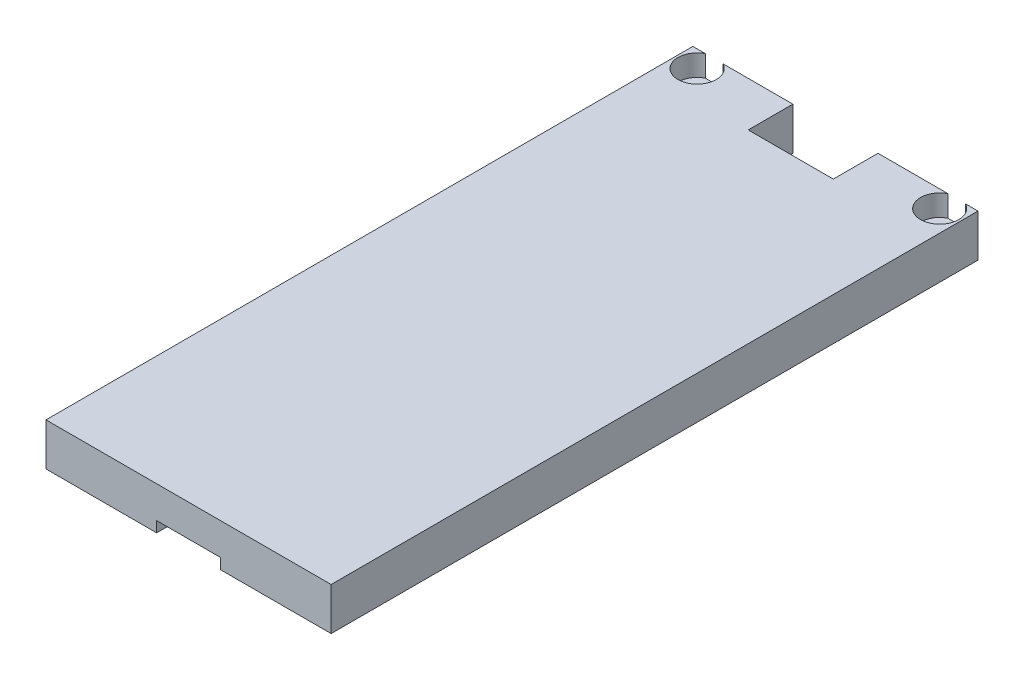
ISO-10303-21;
HEADER;
FILE_DESCRIPTION(('STEP AP214'),'2;1');
FILE_NAME('part.step','',(''),(''),'','','');
FILE_SCHEMA(('AUTOMOTIVE_DESIGN { 1 0 10303 214 1 1 1 1 }'));
ENDSEC;
DATA;
#1=APPLICATION_CONTEXT('core data for automotive mechanical design processes');
#2=APPLICATION_PROTOCOL_DEFINITION('international standard','automotive_design',2000,#1);
#3=PRODUCT_CONTEXT('',#1,'mechanical');
#4=PRODUCT('Part','Part','',(#3));
#5=PRODUCT_RELATED_PRODUCT_CATEGORY('part','',(#4));
#6=PRODUCT_DEFINITION_FORMATION('','',#4);
#7=PRODUCT_DEFINITION_CONTEXT('part definition',#1,'design');
#8=PRODUCT_DEFINITION('design','',#6,#7);
#9=PRODUCT_DEFINITION_SHAPE('','',#8);
#10=(LENGTH_UNIT() NAMED_UNIT(*) SI_UNIT(.MILLI.,.METRE.));
#11=(NAMED_UNIT(*) PLANE_ANGLE_UNIT() SI_UNIT($,.RADIAN.));
#12=(NAMED_UNIT(*) SI_UNIT($,.STERADIAN.) SOLID_ANGLE_UNIT());
#13=UNCERTAINTY_MEASURE_WITH_UNIT(LENGTH_MEASURE(1.E-05),#10,'distance_accuracy_value','');
#14=(GEOMETRIC_REPRESENTATION_CONTEXT(3) GLOBAL_UNCERTAINTY_ASSIGNED_CONTEXT((#13)) GLOBAL_UNIT_ASSIGNED_CONTEXT((#10,
#11,#12)) REPRESENTATION_CONTEXT('',''));
#15=CARTESIAN_POINT('',(0.,0.,0.));
#16=DIRECTION('',(0.,0.,1.));
#17=DIRECTION('',(1.,0.,0.));
#18=AXIS2_PLACEMENT_3D('',#15,#16,#17);
#19=CARTESIAN_POINT('',(0.,0.,0.));
#20=DIRECTION('',(0.,0.,-1.));
#21=DIRECTION('',(-1.,0.,0.));
#22=AXIS2_PLACEMENT_3D('',#19,#20,#21);
#23=PLANE('',#22);
#24=DIRECTION('',(-1.,0.,0.));
#25=VECTOR('',#24,1.);
#26=CARTESIAN_POINT('',(-33.5,10.,0.));
#27=LINE('',#26,#25);
#28=CARTESIAN_POINT('',(26.44,9.99999999999999,0.));
#29=VERTEX_POINT('',#28);
#30=CARTESIAN_POINT('',(10.,9.99999999999999,0.));
#31=VERTEX_POINT('',#30);
#32=EDGE_CURVE('E160',#29,#31,#27,.T.);
#33=ORIENTED_EDGE('',*,*,#32,.F.);
#34=DIRECTION('',(0.,1.,0.));
#35=VECTOR('',#34,1.);
#36=CARTESIAN_POINT('',(26.44,4.99999999999999,0.));
#37=LINE('',#36,#35);
#38=CARTESIAN_POINT('',(26.44,4.99999999999999,0.));
#39=VERTEX_POINT('',#38);
#40=EDGE_CURVE('E148',#39,#29,#37,.T.);
#41=ORIENTED_EDGE('',*,*,#40,.F.);
#42=DIRECTION('',(1.,0.,0.));
#43=VECTOR('',#42,1.);
#44=CARTESIAN_POINT('',(0.,4.99999999999999,0.));
#45=LINE('',#44,#43);
#46=CARTESIAN_POINT('',(30.56,5.,0.));
#47=VERTEX_POINT('',#46);
#48=EDGE_CURVE('E152',#39,#47,#45,.T.);
#49=ORIENTED_EDGE('',*,*,#48,.T.);
#50=DIRECTION('',(0.,1.,0.));
#51=VECTOR('',#50,1.);
#52=CARTESIAN_POINT('',(30.56,4.99999999999999,0.));
#53=LINE('',#52,#51);
#54=CARTESIAN_POINT('',(30.56,9.99999999999999,0.));
#55=VERTEX_POINT('',#54);
#56=EDGE_CURVE('E48',#47,#55,#53,.T.);
#57=ORIENTED_EDGE('',*,*,#56,.T.);
#58=CARTESIAN_POINT('',(33.5,9.99999999999999,0.));
#59=VERTEX_POINT('',#58);
#60=EDGE_CURVE('E245',#59,#55,#27,.T.);
#61=ORIENTED_EDGE('',*,*,#60,.F.);
#62=DIRECTION('',(0.,1.,0.));
#63=VECTOR('',#62,1.);
#64=CARTESIAN_POINT('',(33.5,9.99999999999999,0.));
#65=LINE('',#64,#63);
#66=CARTESIAN_POINT('',(33.5,0.,0.));
#67=VERTEX_POINT('',#66);
#68=EDGE_CURVE('E242',#67,#59,#65,.T.);
#69=ORIENTED_EDGE('',*,*,#68,.F.);
#70=DIRECTION('',(1.,0.,0.));
#71=VECTOR('',#70,1.);
#72=CARTESIAN_POINT('',(33.5,0.,0.));
#73=LINE('',#72,#71);
#74=CARTESIAN_POINT('',(10.,0.,0.));
#75=VERTEX_POINT('',#74);
#76=EDGE_CURVE('E240',#75,#67,#73,.T.);
#77=ORIENTED_EDGE('',*,*,#76,.F.);
#78=DIRECTION('',(0.,1.,0.));
#79=VECTOR('',#78,1.);
#80=CARTESIAN_POINT('',(10.,0.,0.));
#81=LINE('',#80,#79);
#82=EDGE_CURVE('E205',#75,#31,#81,.T.);
#83=ORIENTED_EDGE('',*,*,#82,.T.);
#84=EDGE_LOOP('',(#33,#41,#49,#57,#61,#69,#77,#83));
#85=FACE_BOUND('',#84,.T.);
#86=ADVANCED_FACE('F33',(#85),#23,.T.);
#87=DIRECTION('',(0.,1.,0.));
#88=VECTOR('',#87,1.);
#89=CARTESIAN_POINT('',(-30.56,4.99999999999999,0.));
#90=LINE('',#89,#88);
#91=CARTESIAN_POINT('',(-30.56,4.99999999999999,0.));
#92=VERTEX_POINT('',#91);
#93=CARTESIAN_POINT('',(-30.56,10.,0.));
#94=VERTEX_POINT('',#93);
#95=EDGE_CURVE('E56',#92,#94,#90,.T.);
#96=ORIENTED_EDGE('',*,*,#95,.F.);
#97=DIRECTION('',(-1.,0.,0.));
#98=VECTOR('',#97,1.);
#99=CARTESIAN_POINT('',(0.,4.99999999999999,0.));
#100=LINE('',#99,#98);
#101=CARTESIAN_POINT('',(-26.44,4.99999999999999,0.));
#102=VERTEX_POINT('',#101);
#103=EDGE_CURVE('E172',#102,#92,#100,.T.);
#104=ORIENTED_EDGE('',*,*,#103,.F.);
#105=DIRECTION('',(0.,1.,0.));
#106=VECTOR('',#105,1.);
#107=CARTESIAN_POINT('',(-26.44,4.99999999999999,0.));
#108=LINE('',#107,#106);
#109=CARTESIAN_POINT('',(-26.44,9.99999999999999,0.));
#110=VERTEX_POINT('',#109);
#111=EDGE_CURVE('E178',#102,#110,#108,.T.);
#112=ORIENTED_EDGE('',*,*,#111,.T.);
#113=CARTESIAN_POINT('',(-10.,9.99999999999999,0.));
#114=VERTEX_POINT('',#113);
#115=EDGE_CURVE('E248',#114,#110,#27,.T.);
#116=ORIENTED_EDGE('',*,*,#115,.F.);
#117=DIRECTION('',(0.,1.,0.));
#118=VECTOR('',#117,1.);
#119=CARTESIAN_POINT('',(-10.,0.,0.));
#120=LINE('',#119,#118);
#121=CARTESIAN_POINT('',(-10.,0.,0.));
#122=VERTEX_POINT('',#121);
#123=EDGE_CURVE('E202',#122,#114,#120,.T.);
#124=ORIENTED_EDGE('',*,*,#123,.F.);
#125=DIRECTION('',(1.,0.,0.));
#126=VECTOR('',#125,1.);
#127=CARTESIAN_POINT('',(-7.5,0.,0.));
#128=LINE('',#127,#126);
#129=CARTESIAN_POINT('',(-33.5,0.,0.));
#130=VERTEX_POINT('',#129);
#131=EDGE_CURVE('E218',#130,#122,#128,.T.);
#132=ORIENTED_EDGE('',*,*,#131,.F.);
#133=DIRECTION('',(0.,-1.,0.));
#134=VECTOR('',#133,1.);
#135=CARTESIAN_POINT('',(-33.5,0.,0.));
#136=LINE('',#135,#134);
#137=CARTESIAN_POINT('',(-33.5,10.,0.));
#138=VERTEX_POINT('',#137);
#139=EDGE_CURVE('E223',#138,#130,#136,.T.);
#140=ORIENTED_EDGE('',*,*,#139,.F.);
#141=EDGE_CURVE('E244',#94,#138,#27,.T.);
#142=ORIENTED_EDGE('',*,*,#141,.F.);
#143=EDGE_LOOP('',(#96,#104,#112,#116,#124,#132,#140,#142));
#144=FACE_BOUND('',#143,.T.);
#145=ADVANCED_FACE('F287',(#144),#23,.T.);
#146=CARTESIAN_POINT('',(-7.5,0.,152.));
#147=DIRECTION('',(0.,1.,0.));
#148=DIRECTION('',(-1.,0.,0.));
#149=AXIS2_PLACEMENT_3D('',#146,#147,#148);
#150=PLANE('',#149);
#151=CARTESIAN_POINT('',(-28.5,0.,4.000799920016));
#152=DIRECTION('',(0.,1.,0.));
#153=DIRECTION('',(-1.,0.,0.));
#154=AXIS2_PLACEMENT_3D('',#151,#152,#153);
#155=CIRCLE('',#154,2.6);
#156=CARTESIAN_POINT('',(-31.1,0.,4.000799920016));
#157=VERTEX_POINT('',#156);
#158=EDGE_CURVE('E166',#157,#157,#155,.T.);
#159=ORIENTED_EDGE('',*,*,#158,.T.);
#160=EDGE_LOOP('',(#159));
#161=FACE_BOUND('',#160,.T.);
#162=ORIENTED_EDGE('',*,*,#131,.T.);
#163=DIRECTION('',(0.,0.,1.));
#164=VECTOR('',#163,1.);
#165=CARTESIAN_POINT('',(-10.,0.,0.));
#166=LINE('',#165,#164);
#167=CARTESIAN_POINT('',(-10.,0.,10.5));
#168=VERTEX_POINT('',#167);
#169=EDGE_CURVE('E183',#122,#168,#166,.T.);
#170=ORIENTED_EDGE('',*,*,#169,.T.);
#171=DIRECTION('',(1.,0.,0.));
#172=VECTOR('',#171,1.);
#173=CARTESIAN_POINT('',(-10.,0.,10.5));
#174=LINE('',#173,#172);
#175=CARTESIAN_POINT('',(-7.5,0.,10.5));
#176=VERTEX_POINT('',#175);
#177=EDGE_CURVE('E188',#168,#176,#174,.T.);
#178=ORIENTED_EDGE('',*,*,#177,.T.);
#179=DIRECTION('',(0.,0.,-1.));
#180=VECTOR('',#179,1.);
#181=CARTESIAN_POINT('',(-7.5,0.,152.));
#182=LINE('',#181,#180);
#183=CARTESIAN_POINT('',(-7.5,0.,152.));
#184=VERTEX_POINT('',#183);
#185=EDGE_CURVE('E11',#184,#176,#182,.T.);
#186=ORIENTED_EDGE('',*,*,#185,.F.);
#187=DIRECTION('',(1.,0.,0.));
#188=VECTOR('',#187,1.);
#189=CARTESIAN_POINT('',(-7.5,0.,152.));
#190=LINE('',#189,#188);
#191=CARTESIAN_POINT('',(-33.5,0.,152.));
#192=VERTEX_POINT('',#191);
#193=EDGE_CURVE('E219',#192,#184,#190,.T.);
#194=ORIENTED_EDGE('',*,*,#193,.F.);
#195=DIRECTION('',(0.,0.,-1.));
#196=VECTOR('',#195,1.);
#197=CARTESIAN_POINT('',(-33.5,0.,152.));
#198=LINE('',#197,#196);
#199=EDGE_CURVE('E237',#192,#130,#198,.T.);
#200=ORIENTED_EDGE('',*,*,#199,.T.);
#201=EDGE_LOOP('',(#162,#170,#178,#186,#194,#200));
#202=FACE_BOUND('',#201,.T.);
#203=ADVANCED_FACE('F35',(#161,#202),#150,.F.);
#204=CARTESIAN_POINT('',(-7.5,2.5,152.));
#205=DIRECTION('',(-1.,0.,0.));
#206=DIRECTION('',(0.,-1.,0.));
#207=AXIS2_PLACEMENT_3D('',#204,#205,#206);
#208=PLANE('',#207);
#209=ORIENTED_EDGE('',*,*,#185,.T.);
#210=DIRECTION('',(0.,1.,0.));
#211=VECTOR('',#210,1.);
#212=CARTESIAN_POINT('',(-7.5,2.5,10.5));
#213=LINE('',#212,#211);
#214=CARTESIAN_POINT('',(-7.5,2.5,10.5));
#215=VERTEX_POINT('',#214);
#216=EDGE_CURVE('E215',#176,#215,#213,.T.);
#217=ORIENTED_EDGE('',*,*,#216,.T.);
#218=DIRECTION('',(0.,0.,-1.));
#219=VECTOR('',#218,1.);
#220=CARTESIAN_POINT('',(-7.5,2.5,152.));
#221=LINE('',#220,#219);
#222=CARTESIAN_POINT('',(-7.5,2.5,152.));
#223=VERTEX_POINT('',#222);
#224=EDGE_CURVE('E41',#223,#215,#221,.T.);
#225=ORIENTED_EDGE('',*,*,#224,.F.);
#226=DIRECTION('',(0.,1.,0.));
#227=VECTOR('',#226,1.);
#228=CARTESIAN_POINT('',(-7.5,2.5,152.));
#229=LINE('',#228,#227);
#230=EDGE_CURVE('E222',#184,#223,#229,.T.);
#231=ORIENTED_EDGE('',*,*,#230,.F.);
#232=EDGE_LOOP('',(#209,#217,#225,#231));
#233=FACE_BOUND('',#232,.T.);
#234=ADVANCED_FACE('F273',(#233),#208,.F.);
#235=CARTESIAN_POINT('',(7.5,2.5,152.));
#236=DIRECTION('',(0.,1.,0.));
#237=DIRECTION('',(-1.,0.,0.));
#238=AXIS2_PLACEMENT_3D('',#235,#236,#237);
#239=PLANE('',#238);
#240=ORIENTED_EDGE('',*,*,#224,.T.);
#241=DIRECTION('',(1.,0.,0.));
#242=VECTOR('',#241,1.);
#243=CARTESIAN_POINT('',(7.50000000000002,2.5,10.5));
#244=LINE('',#243,#242);
#245=CARTESIAN_POINT('',(7.5,2.5,10.5));
#246=VERTEX_POINT('',#245);
#247=EDGE_CURVE('E212',#215,#246,#244,.T.);
#248=ORIENTED_EDGE('',*,*,#247,.T.);
#249=DIRECTION('',(0.,0.,-1.));
#250=VECTOR('',#249,1.);
#251=CARTESIAN_POINT('',(7.5,2.5,152.));
#252=LINE('',#251,#250);
#253=CARTESIAN_POINT('',(7.5,2.5,152.));
#254=VERTEX_POINT('',#253);
#255=EDGE_CURVE('E264',#254,#246,#252,.T.);
#256=ORIENTED_EDGE('',*,*,#255,.F.);
#257=DIRECTION('',(1.,0.,0.));
#258=VECTOR('',#257,1.);
#259=CARTESIAN_POINT('',(7.5,2.5,152.));
#260=LINE('',#259,#258);
#261=EDGE_CURVE('E225',#223,#254,#260,.T.);
#262=ORIENTED_EDGE('',*,*,#261,.F.);
#263=EDGE_LOOP('',(#240,#248,#256,#262));
#264=FACE_BOUND('',#263,.T.);
#265=ADVANCED_FACE('F270',(#264),#239,.F.);
#266=CARTESIAN_POINT('',(7.5,0.,152.));
#267=DIRECTION('',(1.,0.,0.));
#268=DIRECTION('',(0.,1.,0.));
#269=AXIS2_PLACEMENT_3D('',#266,#267,#268);
#270=PLANE('',#269);
#271=ORIENTED_EDGE('',*,*,#255,.T.);
#272=DIRECTION('',(0.,-1.,0.));
#273=VECTOR('',#272,1.);
#274=CARTESIAN_POINT('',(7.5,0.,10.5));
#275=LINE('',#274,#273);
#276=CARTESIAN_POINT('',(7.5,0.,10.5));
#277=VERTEX_POINT('',#276);
#278=EDGE_CURVE('E204',#246,#277,#275,.T.);
#279=ORIENTED_EDGE('',*,*,#278,.T.);
#280=DIRECTION('',(0.,0.,-1.));
#281=VECTOR('',#280,1.);
#282=CARTESIAN_POINT('',(7.5,0.,152.));
#283=LINE('',#282,#281);
#284=CARTESIAN_POINT('',(7.5,0.,152.));
#285=VERTEX_POINT('',#284);
#286=EDGE_CURVE('E261',#285,#277,#283,.T.);
#287=ORIENTED_EDGE('',*,*,#286,.F.);
#288=DIRECTION('',(0.,-1.,0.));
#289=VECTOR('',#288,1.);
#290=CARTESIAN_POINT('',(7.5,0.,152.));
#291=LINE('',#290,#289);
#292=EDGE_CURVE('E227',#254,#285,#291,.T.);
#293=ORIENTED_EDGE('',*,*,#292,.F.);
#294=EDGE_LOOP('',(#271,#279,#287,#293));
#295=FACE_BOUND('',#294,.T.);
#296=ADVANCED_FACE('F352',(#295),#270,.F.);
#297=CARTESIAN_POINT('',(33.5,0.,152.));
#298=DIRECTION('',(0.,1.,0.));
#299=DIRECTION('',(-1.,0.,0.));
#300=AXIS2_PLACEMENT_3D('',#297,#298,#299);
#301=PLANE('',#300);
#302=CARTESIAN_POINT('',(28.5,0.,4.000799920016));
#303=DIRECTION('',(0.,-1.,0.));
#304=DIRECTION('',(1.,0.,0.));
#305=AXIS2_PLACEMENT_3D('',#302,#303,#304);
#306=CIRCLE('',#305,2.6);
#307=CARTESIAN_POINT('',(31.1,0.,4.000799920016));
#308=VERTEX_POINT('',#307);
#309=EDGE_CURVE('E319',#308,#308,#306,.T.);
#310=ORIENTED_EDGE('',*,*,#309,.F.);
#311=EDGE_LOOP('',(#310));
#312=FACE_BOUND('',#311,.T.);
#313=CARTESIAN_POINT('',(10.,0.,10.5));
#314=VERTEX_POINT('',#313);
#315=EDGE_CURVE('E186',#277,#314,#174,.T.);
#316=ORIENTED_EDGE('',*,*,#315,.T.);
#317=DIRECTION('',(0.,0.,-1.));
#318=VECTOR('',#317,1.);
#319=CARTESIAN_POINT('',(10.,0.,0.));
#320=LINE('',#319,#318);
#321=EDGE_CURVE('E191',#314,#75,#320,.T.);
#322=ORIENTED_EDGE('',*,*,#321,.T.);
#323=ORIENTED_EDGE('',*,*,#76,.T.);
#324=DIRECTION('',(0.,0.,-1.));
#325=VECTOR('',#324,1.);
#326=CARTESIAN_POINT('',(33.5,0.,152.));
#327=LINE('',#326,#325);
#328=CARTESIAN_POINT('',(33.5,0.,152.));
#329=VERTEX_POINT('',#328);
#330=EDGE_CURVE('E258',#329,#67,#327,.T.);
#331=ORIENTED_EDGE('',*,*,#330,.F.);
#332=DIRECTION('',(1.,0.,0.));
#333=VECTOR('',#332,1.);
#334=CARTESIAN_POINT('',(33.5,0.,152.));
#335=LINE('',#334,#333);
#336=EDGE_CURVE('E229',#285,#329,#335,.T.);
#337=ORIENTED_EDGE('',*,*,#336,.F.);
#338=ORIENTED_EDGE('',*,*,#286,.T.);
#339=EDGE_LOOP('',(#316,#322,#323,#331,#337,#338));
#340=FACE_BOUND('',#339,.T.);
#341=ADVANCED_FACE('F313',(#312,#340),#301,.F.);
#342=CARTESIAN_POINT('',(33.5,9.99999999999999,152.));
#343=DIRECTION('',(-1.,0.,0.));
#344=DIRECTION('',(0.,0.,1.));
#345=AXIS2_PLACEMENT_3D('',#342,#343,#344);
#346=PLANE('',#345);
#347=ORIENTED_EDGE('',*,*,#68,.T.);
#348=DIRECTION('',(0.,0.,-1.));
#349=VECTOR('',#348,1.);
#350=CARTESIAN_POINT('',(33.5,9.99999999999999,152.));
#351=LINE('',#350,#349);
#352=CARTESIAN_POINT('',(33.5,9.99999999999999,152.));
#353=VERTEX_POINT('',#352);
#354=EDGE_CURVE('E255',#353,#59,#351,.T.);
#355=ORIENTED_EDGE('',*,*,#354,.F.);
#356=DIRECTION('',(0.,1.,0.));
#357=VECTOR('',#356,1.);
#358=CARTESIAN_POINT('',(33.5,9.99999999999999,152.));
#359=LINE('',#358,#357);
#360=EDGE_CURVE('E231',#329,#353,#359,.T.);
#361=ORIENTED_EDGE('',*,*,#360,.F.);
#362=ORIENTED_EDGE('',*,*,#330,.T.);
#363=EDGE_LOOP('',(#347,#355,#361,#362));
#364=FACE_BOUND('',#363,.T.);
#365=ADVANCED_FACE('F308',(#364),#346,.F.);
#366=CARTESIAN_POINT('',(-33.5,10.,152.));
#367=DIRECTION('',(0.,-1.,0.));
#368=DIRECTION('',(1.,0.,0.));
#369=AXIS2_PLACEMENT_3D('',#366,#367,#368);
#370=PLANE('',#369);
#371=CARTESIAN_POINT('',(28.5,9.99999999999999,4.000799920016));
#372=DIRECTION('',(0.,-1.,0.));
#373=DIRECTION('',(1.,0.,0.));
#374=AXIS2_PLACEMENT_3D('',#371,#372,#373);
#375=CIRCLE('',#374,4.5);
#376=EDGE_CURVE('E156',#55,#29,#375,.T.);
#377=ORIENTED_EDGE('',*,*,#376,.T.);
#378=ORIENTED_EDGE('',*,*,#32,.T.);
#379=DIRECTION('',(0.,0.,-1.));
#380=VECTOR('',#379,1.);
#381=CARTESIAN_POINT('',(10.,9.99999999999999,0.));
#382=LINE('',#381,#380);
#383=CARTESIAN_POINT('',(10.,9.99999999999999,10.5));
#384=VERTEX_POINT('',#383);
#385=EDGE_CURVE('E187',#384,#31,#382,.T.);
#386=ORIENTED_EDGE('',*,*,#385,.F.);
#387=DIRECTION('',(1.,0.,0.));
#388=VECTOR('',#387,1.);
#389=CARTESIAN_POINT('',(-10.,9.99999999999999,10.5));
#390=LINE('',#389,#388);
#391=CARTESIAN_POINT('',(-10.,9.99999999999999,10.5));
#392=VERTEX_POINT('',#391);
#393=EDGE_CURVE('E197',#392,#384,#390,.T.);
#394=ORIENTED_EDGE('',*,*,#393,.F.);
#395=DIRECTION('',(0.,0.,1.));
#396=VECTOR('',#395,1.);
#397=CARTESIAN_POINT('',(-10.,9.99999999999999,0.));
#398=LINE('',#397,#396);
#399=EDGE_CURVE('E181',#114,#392,#398,.T.);
#400=ORIENTED_EDGE('',*,*,#399,.F.);
#401=ORIENTED_EDGE('',*,*,#115,.T.);
#402=CARTESIAN_POINT('',(-28.5,9.99999999999999,4.000799920016));
#403=DIRECTION('',(0.,1.,0.));
#404=DIRECTION('',(-1.,0.,0.));
#405=AXIS2_PLACEMENT_3D('',#402,#403,#404);
#406=CIRCLE('',#405,4.5);
#407=EDGE_CURVE('E169',#94,#110,#406,.T.);
#408=ORIENTED_EDGE('',*,*,#407,.F.);
#409=ORIENTED_EDGE('',*,*,#141,.T.);
#410=DIRECTION('',(0.,0.,-1.));
#411=VECTOR('',#410,1.);
#412=CARTESIAN_POINT('',(-33.5,10.,152.));
#413=LINE('',#412,#411);
#414=CARTESIAN_POINT('',(-33.5,10.,152.));
#415=VERTEX_POINT('',#414);
#416=EDGE_CURVE('E252',#415,#138,#413,.T.);
#417=ORIENTED_EDGE('',*,*,#416,.F.);
#418=DIRECTION('',(-1.,0.,0.));
#419=VECTOR('',#418,1.);
#420=CARTESIAN_POINT('',(-33.5,10.,152.));
#421=LINE('',#420,#419);
#422=EDGE_CURVE('E233',#353,#415,#421,.T.);
#423=ORIENTED_EDGE('',*,*,#422,.F.);
#424=ORIENTED_EDGE('',*,*,#354,.T.);
#425=ORIENTED_EDGE('',*,*,#60,.T.);
#426=EDGE_LOOP('',(#377,#378,#386,#394,#400,#401,#408,#409,#417,#423,#424,#425));
#427=FACE_BOUND('',#426,.T.);
#428=ADVANCED_FACE('F294',(#427),#370,.F.);
#429=CARTESIAN_POINT('',(-33.5,0.,152.));
#430=DIRECTION('',(1.,0.,0.));
#431=DIRECTION('',(0.,0.,-1.));
#432=AXIS2_PLACEMENT_3D('',#429,#430,#431);
#433=PLANE('',#432);
#434=ORIENTED_EDGE('',*,*,#139,.T.);
#435=ORIENTED_EDGE('',*,*,#199,.F.);
#436=DIRECTION('',(0.,-1.,0.));
#437=VECTOR('',#436,1.);
#438=CARTESIAN_POINT('',(-33.5,0.,152.));
#439=LINE('',#438,#437);
#440=EDGE_CURVE('E235',#415,#192,#439,.T.);
#441=ORIENTED_EDGE('',*,*,#440,.F.);
#442=ORIENTED_EDGE('',*,*,#416,.T.);
#443=EDGE_LOOP('',(#434,#435,#441,#442));
#444=FACE_BOUND('',#443,.T.);
#445=ADVANCED_FACE('F298',(#444),#433,.F.);
#446=CARTESIAN_POINT('',(0.,0.,152.));
#447=DIRECTION('',(0.,0.,-1.));
#448=DIRECTION('',(-1.,0.,0.));
#449=AXIS2_PLACEMENT_3D('',#446,#447,#448);
#450=PLANE('',#449);
#451=ORIENTED_EDGE('',*,*,#193,.T.);
#452=ORIENTED_EDGE('',*,*,#230,.T.);
#453=ORIENTED_EDGE('',*,*,#261,.T.);
#454=ORIENTED_EDGE('',*,*,#292,.T.);
#455=ORIENTED_EDGE('',*,*,#336,.T.);
#456=ORIENTED_EDGE('',*,*,#360,.T.);
#457=ORIENTED_EDGE('',*,*,#422,.T.);
#458=ORIENTED_EDGE('',*,*,#440,.T.);
#459=EDGE_LOOP('',(#451,#452,#453,#454,#455,#456,#457,#458));
#460=FACE_BOUND('',#459,.T.);
#461=ADVANCED_FACE('F301',(#460),#450,.F.);
#462=CARTESIAN_POINT('',(-10.,0.,10.5));
#463=DIRECTION('',(0.,0.,1.));
#464=DIRECTION('',(1.,0.,0.));
#465=AXIS2_PLACEMENT_3D('',#462,#463,#464);
#466=PLANE('',#465);
#467=ORIENTED_EDGE('',*,*,#177,.F.);
#468=DIRECTION('',(0.,1.,0.));
#469=VECTOR('',#468,1.);
#470=CARTESIAN_POINT('',(-10.,0.,10.5));
#471=LINE('',#470,#469);
#472=EDGE_CURVE('E194',#168,#392,#471,.T.);
#473=ORIENTED_EDGE('',*,*,#472,.T.);
#474=ORIENTED_EDGE('',*,*,#393,.T.);
#475=DIRECTION('',(0.,1.,0.));
#476=VECTOR('',#475,1.);
#477=CARTESIAN_POINT('',(10.,0.,10.5));
#478=LINE('',#477,#476);
#479=EDGE_CURVE('E207',#314,#384,#478,.T.);
#480=ORIENTED_EDGE('',*,*,#479,.F.);
#481=ORIENTED_EDGE('',*,*,#315,.F.);
#482=ORIENTED_EDGE('',*,*,#278,.F.);
#483=ORIENTED_EDGE('',*,*,#247,.F.);
#484=ORIENTED_EDGE('',*,*,#216,.F.);
#485=EDGE_LOOP('',(#467,#473,#474,#480,#481,#482,#483,#484));
#486=FACE_BOUND('',#485,.T.);
#487=ADVANCED_FACE('F277',(#486),#466,.F.);
#488=CARTESIAN_POINT('',(-10.,0.,0.));
#489=DIRECTION('',(-1.,0.,0.));
#490=DIRECTION('',(0.,0.,1.));
#491=AXIS2_PLACEMENT_3D('',#488,#489,#490);
#492=PLANE('',#491);
#493=ORIENTED_EDGE('',*,*,#399,.T.);
#494=ORIENTED_EDGE('',*,*,#472,.F.);
#495=ORIENTED_EDGE('',*,*,#169,.F.);
#496=ORIENTED_EDGE('',*,*,#123,.T.);
#497=EDGE_LOOP('',(#493,#494,#495,#496));
#498=FACE_BOUND('',#497,.T.);
#499=ADVANCED_FACE('F283',(#498),#492,.F.);
#500=CARTESIAN_POINT('',(10.,0.,0.));
#501=DIRECTION('',(1.,0.,0.));
#502=DIRECTION('',(0.,0.,-1.));
#503=AXIS2_PLACEMENT_3D('',#500,#501,#502);
#504=PLANE('',#503);
#505=ORIENTED_EDGE('',*,*,#385,.T.);
#506=ORIENTED_EDGE('',*,*,#82,.F.);
#507=ORIENTED_EDGE('',*,*,#321,.F.);
#508=ORIENTED_EDGE('',*,*,#479,.T.);
#509=EDGE_LOOP('',(#505,#506,#507,#508));
#510=FACE_BOUND('',#509,.T.);
#511=ADVANCED_FACE('F316',(#510),#504,.F.);
#512=CARTESIAN_POINT('',(-28.5,4.99999999999999,4.000799920016));
#513=DIRECTION('',(0.,1.,0.));
#514=DIRECTION('',(-1.,0.,0.));
#515=AXIS2_PLACEMENT_3D('',#512,#513,#514);
#516=CYLINDRICAL_SURFACE('',#515,4.5);
#517=ORIENTED_EDGE('',*,*,#407,.T.);
#518=ORIENTED_EDGE('',*,*,#111,.F.);
#519=CARTESIAN_POINT('',(-28.5,4.99999999999999,4.000799920016));
#520=DIRECTION('',(0.,1.,0.));
#521=DIRECTION('',(-1.,0.,0.));
#522=AXIS2_PLACEMENT_3D('',#519,#520,#521);
#523=CIRCLE('',#522,4.5);
#524=EDGE_CURVE('E174',#92,#102,#523,.T.);
#525=ORIENTED_EDGE('',*,*,#524,.F.);
#526=ORIENTED_EDGE('',*,*,#95,.T.);
#527=EDGE_LOOP('',(#517,#518,#525,#526));
#528=FACE_BOUND('',#527,.T.);
#529=ADVANCED_FACE('F376',(#528),#516,.F.);
#530=CARTESIAN_POINT('',(0.,4.99999999999999,0.));
#531=DIRECTION('',(0.,1.,0.));
#532=DIRECTION('',(-1.,0.,0.));
#533=AXIS2_PLACEMENT_3D('',#530,#531,#532);
#534=PLANE('',#533);
#535=CARTESIAN_POINT('',(-28.5,5.,4.000799920016));
#536=DIRECTION('',(0.,1.,0.));
#537=DIRECTION('',(-1.,0.,0.));
#538=AXIS2_PLACEMENT_3D('',#535,#536,#537);
#539=CIRCLE('',#538,2.6);
#540=CARTESIAN_POINT('',(-31.1,5.,4.000799920016));
#541=VERTEX_POINT('',#540);
#542=EDGE_CURVE('E162',#541,#541,#539,.T.);
#543=ORIENTED_EDGE('',*,*,#542,.F.);
#544=EDGE_LOOP('',(#543));
#545=FACE_BOUND('',#544,.T.);
#546=ORIENTED_EDGE('',*,*,#103,.T.);
#547=ORIENTED_EDGE('',*,*,#524,.T.);
#548=EDGE_LOOP('',(#546,#547));
#549=FACE_BOUND('',#548,.T.);
#550=ADVANCED_FACE('F370',(#545,#549),#534,.T.);
#551=CARTESIAN_POINT('',(-28.5,0.,4.000799920016));
#552=DIRECTION('',(0.,1.,0.));
#553=DIRECTION('',(-1.,0.,0.));
#554=AXIS2_PLACEMENT_3D('',#551,#552,#553);
#555=CYLINDRICAL_SURFACE('',#554,2.6);
#556=ORIENTED_EDGE('',*,*,#158,.F.);
#557=EDGE_LOOP('',(#556));
#558=FACE_BOUND('',#557,.T.);
#559=ORIENTED_EDGE('',*,*,#542,.T.);
#560=EDGE_LOOP('',(#559));
#561=FACE_BOUND('',#560,.T.);
#562=ADVANCED_FACE('F367',(#558,#561),#555,.F.);
#563=CARTESIAN_POINT('',(28.5,4.99999999999999,4.000799920016));
#564=DIRECTION('',(0.,1.,0.));
#565=DIRECTION('',(-1.,0.,0.));
#566=AXIS2_PLACEMENT_3D('',#563,#564,#565);
#567=CYLINDRICAL_SURFACE('',#566,4.5);
#568=ORIENTED_EDGE('',*,*,#376,.F.);
#569=ORIENTED_EDGE('',*,*,#56,.F.);
#570=CARTESIAN_POINT('',(28.5,4.99999999999999,4.000799920016));
#571=DIRECTION('',(0.,-1.,0.));
#572=DIRECTION('',(1.,0.,0.));
#573=AXIS2_PLACEMENT_3D('',#570,#571,#572);
#574=CIRCLE('',#573,4.5);
#575=EDGE_CURVE('E144',#47,#39,#574,.T.);
#576=ORIENTED_EDGE('',*,*,#575,.T.);
#577=ORIENTED_EDGE('',*,*,#40,.T.);
#578=EDGE_LOOP('',(#568,#569,#576,#577));
#579=FACE_BOUND('',#578,.T.);
#580=ADVANCED_FACE('F146',(#579),#567,.F.);
#581=CARTESIAN_POINT('',(0.,4.99999999999999,0.));
#582=DIRECTION('',(0.,1.,0.));
#583=DIRECTION('',(1.,0.,0.));
#584=AXIS2_PLACEMENT_3D('',#581,#582,#583);
#585=PLANE('',#584);
#586=CARTESIAN_POINT('',(28.5,5.,4.000799920016));
#587=DIRECTION('',(0.,-1.,0.));
#588=DIRECTION('',(1.,0.,0.));
#589=AXIS2_PLACEMENT_3D('',#586,#587,#588);
#590=CIRCLE('',#589,2.6);
#591=CARTESIAN_POINT('',(31.1,5.,4.000799920016));
#592=VERTEX_POINT('',#591);
#593=EDGE_CURVE('E321',#592,#592,#590,.T.);
#594=ORIENTED_EDGE('',*,*,#593,.T.);
#595=EDGE_LOOP('',(#594));
#596=FACE_BOUND('',#595,.T.);
#597=ORIENTED_EDGE('',*,*,#48,.F.);
#598=ORIENTED_EDGE('',*,*,#575,.F.);
#599=EDGE_LOOP('',(#597,#598));
#600=FACE_BOUND('',#599,.T.);
#601=ADVANCED_FACE('F154',(#596,#600),#585,.T.);
#602=CARTESIAN_POINT('',(28.5,0.,4.000799920016));
#603=DIRECTION('',(0.,1.,0.));
#604=DIRECTION('',(-1.,0.,0.));
#605=AXIS2_PLACEMENT_3D('',#602,#603,#604);
#606=CYLINDRICAL_SURFACE('',#605,2.6);
#607=ORIENTED_EDGE('',*,*,#309,.T.);
#608=EDGE_LOOP('',(#607));
#609=FACE_BOUND('',#608,.T.);
#610=ORIENTED_EDGE('',*,*,#593,.F.);
#611=EDGE_LOOP('',(#610));
#612=FACE_BOUND('',#611,.T.);
#613=ADVANCED_FACE('F328',(#609,#612),#606,.F.);
#614=CLOSED_SHELL('',(#86,#145,#203,#234,#265,#296,#341,#365,#428,#445,#461,#487,#499,#511,#529,
#550,#562,#580,#601,#613));
#615=MANIFOLD_SOLID_BREP('B2',#614);
#616=ADVANCED_BREP_SHAPE_REPRESENTATION('',(#18,#615),#14);
#617=SHAPE_DEFINITION_REPRESENTATION(#9,#616);
ENDSEC;
END-ISO-10303-21;
